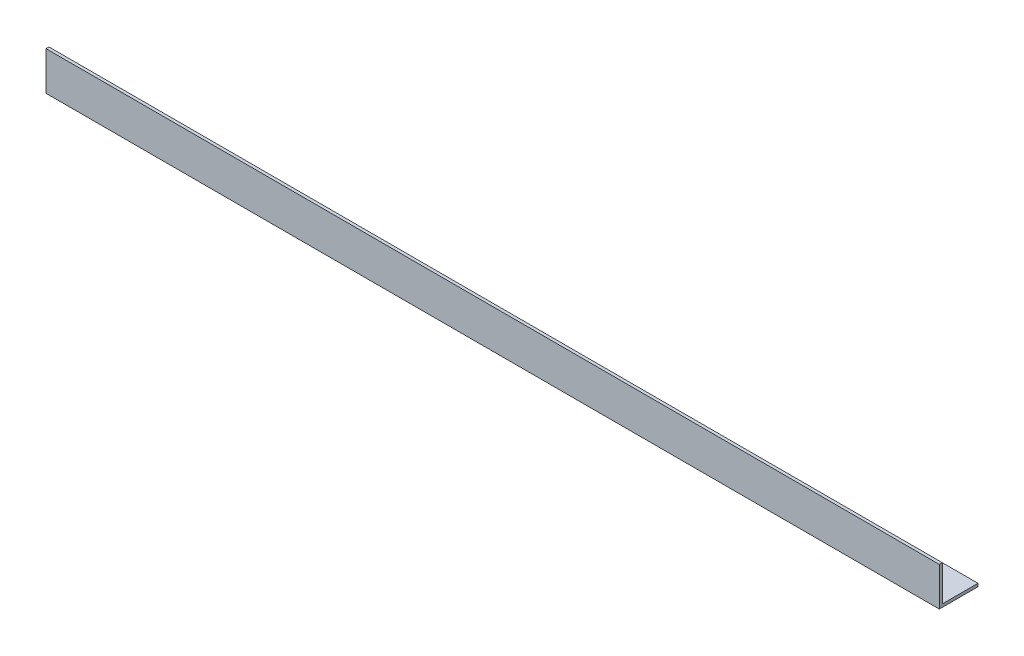
ISO-10303-21;
HEADER;
FILE_DESCRIPTION(('STEP AP214'),'2;1');
FILE_NAME('part.step','',(''),(''),'','','');
FILE_SCHEMA(('AUTOMOTIVE_DESIGN { 1 0 10303 214 1 1 1 1 }'));
ENDSEC;
DATA;
#1=APPLICATION_CONTEXT('core data for automotive mechanical design processes');
#2=APPLICATION_PROTOCOL_DEFINITION('international standard','automotive_design',2000,#1);
#3=PRODUCT_CONTEXT('',#1,'mechanical');
#4=PRODUCT('Part','Part','',(#3));
#5=PRODUCT_RELATED_PRODUCT_CATEGORY('part','',(#4));
#6=PRODUCT_DEFINITION_FORMATION('','',#4);
#7=PRODUCT_DEFINITION_CONTEXT('part definition',#1,'design');
#8=PRODUCT_DEFINITION('design','',#6,#7);
#9=PRODUCT_DEFINITION_SHAPE('','',#8);
#10=(LENGTH_UNIT() NAMED_UNIT(*) SI_UNIT(.MILLI.,.METRE.));
#11=(NAMED_UNIT(*) PLANE_ANGLE_UNIT() SI_UNIT($,.RADIAN.));
#12=(NAMED_UNIT(*) SI_UNIT($,.STERADIAN.) SOLID_ANGLE_UNIT());
#13=UNCERTAINTY_MEASURE_WITH_UNIT(LENGTH_MEASURE(1.E-05),#10,'distance_accuracy_value','');
#14=(GEOMETRIC_REPRESENTATION_CONTEXT(3) GLOBAL_UNCERTAINTY_ASSIGNED_CONTEXT((#13)) GLOBAL_UNIT_ASSIGNED_CONTEXT((#10,
#11,#12)) REPRESENTATION_CONTEXT('',''));
#15=CARTESIAN_POINT('',(0.,0.,0.));
#16=DIRECTION('',(0.,0.,1.));
#17=DIRECTION('',(1.,0.,0.));
#18=AXIS2_PLACEMENT_3D('',#15,#16,#17);
#19=CARTESIAN_POINT('',(1500.,0.,0.));
#20=DIRECTION('',(0.,1.,0.));
#21=DIRECTION('',(0.,0.,1.));
#22=AXIS2_PLACEMENT_3D('',#19,#20,#21);
#23=PLANE('',#22);
#24=DIRECTION('',(0.,0.,-1.));
#25=VECTOR('',#24,1.);
#26=CARTESIAN_POINT('',(0.,0.,0.));
#27=LINE('',#26,#25);
#28=CARTESIAN_POINT('',(0.,0.,0.));
#29=VERTEX_POINT('',#28);
#30=CARTESIAN_POINT('',(0.,0.,-65.));
#31=VERTEX_POINT('',#30);
#32=EDGE_CURVE('E115',#29,#31,#27,.T.);
#33=ORIENTED_EDGE('',*,*,#32,.T.);
#34=DIRECTION('',(-1.,0.,0.));
#35=VECTOR('',#34,1.);
#36=CARTESIAN_POINT('',(1500.,0.,-65.));
#37=LINE('',#36,#35);
#38=CARTESIAN_POINT('',(1500.,0.,-65.));
#39=VERTEX_POINT('',#38);
#40=EDGE_CURVE('E11',#39,#31,#37,.T.);
#41=ORIENTED_EDGE('',*,*,#40,.F.);
#42=DIRECTION('',(0.,0.,-1.));
#43=VECTOR('',#42,1.);
#44=CARTESIAN_POINT('',(1500.,0.,0.));
#45=LINE('',#44,#43);
#46=CARTESIAN_POINT('',(1500.,0.,0.));
#47=VERTEX_POINT('',#46);
#48=EDGE_CURVE('E80',#47,#39,#45,.T.);
#49=ORIENTED_EDGE('',*,*,#48,.F.);
#50=DIRECTION('',(-1.,0.,0.));
#51=VECTOR('',#50,1.);
#52=CARTESIAN_POINT('',(1500.,0.,0.));
#53=LINE('',#52,#51);
#54=EDGE_CURVE('E111',#47,#29,#53,.T.);
#55=ORIENTED_EDGE('',*,*,#54,.T.);
#56=EDGE_LOOP('',(#33,#41,#49,#55));
#57=FACE_BOUND('',#56,.T.);
#58=ADVANCED_FACE('F34',(#57),#23,.F.);
#59=CARTESIAN_POINT('',(1500.,5.,-65.));
#60=DIRECTION('',(0.,0.,-1.));
#61=DIRECTION('',(-1.,0.,0.));
#62=AXIS2_PLACEMENT_3D('',#59,#60,#61);
#63=PLANE('',#62);
#64=DIRECTION('',(0.,-1.,0.));
#65=VECTOR('',#64,1.);
#66=CARTESIAN_POINT('',(0.,5.,-65.));
#67=LINE('',#66,#65);
#68=CARTESIAN_POINT('',(0.,5.,-65.));
#69=VERTEX_POINT('',#68);
#70=EDGE_CURVE('E118',#69,#31,#67,.T.);
#71=ORIENTED_EDGE('',*,*,#70,.F.);
#72=DIRECTION('',(-1.,0.,0.));
#73=VECTOR('',#72,1.);
#74=CARTESIAN_POINT('',(1500.,5.,-65.));
#75=LINE('',#74,#73);
#76=CARTESIAN_POINT('',(1500.,5.,-65.));
#77=VERTEX_POINT('',#76);
#78=EDGE_CURVE('E42',#77,#69,#75,.T.);
#79=ORIENTED_EDGE('',*,*,#78,.F.);
#80=DIRECTION('',(0.,-1.,0.));
#81=VECTOR('',#80,1.);
#82=CARTESIAN_POINT('',(1500.,5.,-65.));
#83=LINE('',#82,#81);
#84=EDGE_CURVE('E204',#77,#39,#83,.T.);
#85=ORIENTED_EDGE('',*,*,#84,.T.);
#86=ORIENTED_EDGE('',*,*,#40,.T.);
#87=EDGE_LOOP('',(#71,#79,#85,#86));
#88=FACE_BOUND('',#87,.T.);
#89=ADVANCED_FACE('F136',(#88),#63,.T.);
#90=CARTESIAN_POINT('',(1500.,5.,0.));
#91=DIRECTION('',(0.,1.,0.));
#92=DIRECTION('',(0.,0.,1.));
#93=AXIS2_PLACEMENT_3D('',#90,#91,#92);
#94=PLANE('',#93);
#95=DIRECTION('',(0.,0.,-1.));
#96=VECTOR('',#95,1.);
#97=CARTESIAN_POINT('',(0.,5.,0.));
#98=LINE('',#97,#96);
#99=CARTESIAN_POINT('',(0.,5.,-5.));
#100=VERTEX_POINT('',#99);
#101=EDGE_CURVE('E121',#100,#69,#98,.T.);
#102=ORIENTED_EDGE('',*,*,#101,.F.);
#103=DIRECTION('',(-1.,0.,0.));
#104=VECTOR('',#103,1.);
#105=CARTESIAN_POINT('',(1500.,5.,-5.));
#106=LINE('',#105,#104);
#107=CARTESIAN_POINT('',(1500.,5.,-5.));
#108=VERTEX_POINT('',#107);
#109=EDGE_CURVE('E101',#108,#100,#106,.T.);
#110=ORIENTED_EDGE('',*,*,#109,.F.);
#111=DIRECTION('',(0.,0.,-1.));
#112=VECTOR('',#111,1.);
#113=CARTESIAN_POINT('',(1500.,5.,0.));
#114=LINE('',#113,#112);
#115=EDGE_CURVE('E107',#108,#77,#114,.T.);
#116=ORIENTED_EDGE('',*,*,#115,.T.);
#117=ORIENTED_EDGE('',*,*,#78,.T.);
#118=EDGE_LOOP('',(#102,#110,#116,#117));
#119=FACE_BOUND('',#118,.T.);
#120=ADVANCED_FACE('F133',(#119),#94,.T.);
#121=CARTESIAN_POINT('',(1500.,0.,-5.));
#122=DIRECTION('',(0.,0.,-1.));
#123=DIRECTION('',(-1.,0.,0.));
#124=AXIS2_PLACEMENT_3D('',#121,#122,#123);
#125=PLANE('',#124);
#126=DIRECTION('',(0.,1.,0.));
#127=VECTOR('',#126,1.);
#128=CARTESIAN_POINT('',(0.,0.,-5.));
#129=LINE('',#128,#127);
#130=CARTESIAN_POINT('',(0.,65.,-5.));
#131=VERTEX_POINT('',#130);
#132=EDGE_CURVE('E96',#131,#100,#129,.F.);
#133=ORIENTED_EDGE('',*,*,#132,.F.);
#134=DIRECTION('',(-1.,0.,0.));
#135=VECTOR('',#134,1.);
#136=CARTESIAN_POINT('',(1500.,65.,-5.));
#137=LINE('',#136,#135);
#138=CARTESIAN_POINT('',(1500.,65.,-5.));
#139=VERTEX_POINT('',#138);
#140=EDGE_CURVE('E91',#139,#131,#137,.T.);
#141=ORIENTED_EDGE('',*,*,#140,.F.);
#142=DIRECTION('',(0.,1.,0.));
#143=VECTOR('',#142,1.);
#144=CARTESIAN_POINT('',(1500.,0.,-5.));
#145=LINE('',#144,#143);
#146=EDGE_CURVE('E94',#139,#108,#145,.F.);
#147=ORIENTED_EDGE('',*,*,#146,.T.);
#148=ORIENTED_EDGE('',*,*,#109,.T.);
#149=EDGE_LOOP('',(#133,#141,#147,#148));
#150=FACE_BOUND('',#149,.T.);
#151=ADVANCED_FACE('F93',(#150),#125,.T.);
#152=CARTESIAN_POINT('',(1500.,65.,0.));
#153=DIRECTION('',(0.,1.,0.));
#154=DIRECTION('',(0.,0.,1.));
#155=AXIS2_PLACEMENT_3D('',#152,#153,#154);
#156=PLANE('',#155);
#157=DIRECTION('',(0.,0.,-1.));
#158=VECTOR('',#157,1.);
#159=CARTESIAN_POINT('',(0.,65.,0.));
#160=LINE('',#159,#158);
#161=CARTESIAN_POINT('',(0.,65.,0.));
#162=VERTEX_POINT('',#161);
#163=EDGE_CURVE('E125',#162,#131,#160,.T.);
#164=ORIENTED_EDGE('',*,*,#163,.F.);
#165=DIRECTION('',(-1.,0.,0.));
#166=VECTOR('',#165,1.);
#167=CARTESIAN_POINT('',(1500.,65.,0.));
#168=LINE('',#167,#166);
#169=CARTESIAN_POINT('',(1500.,65.,0.));
#170=VERTEX_POINT('',#169);
#171=EDGE_CURVE('E71',#170,#162,#168,.T.);
#172=ORIENTED_EDGE('',*,*,#171,.F.);
#173=DIRECTION('',(0.,0.,-1.));
#174=VECTOR('',#173,1.);
#175=CARTESIAN_POINT('',(1500.,65.,0.));
#176=LINE('',#175,#174);
#177=EDGE_CURVE('E105',#170,#139,#176,.T.);
#178=ORIENTED_EDGE('',*,*,#177,.T.);
#179=ORIENTED_EDGE('',*,*,#140,.T.);
#180=EDGE_LOOP('',(#164,#172,#178,#179));
#181=FACE_BOUND('',#180,.T.);
#182=ADVANCED_FACE('F109',(#181),#156,.T.);
#183=CARTESIAN_POINT('',(1500.,0.,0.));
#184=DIRECTION('',(0.,0.,-1.));
#185=DIRECTION('',(-1.,0.,0.));
#186=AXIS2_PLACEMENT_3D('',#183,#184,#185);
#187=PLANE('',#186);
#188=DIRECTION('',(0.,-1.,0.));
#189=VECTOR('',#188,1.);
#190=CARTESIAN_POINT('',(0.,0.,0.));
#191=LINE('',#190,#189);
#192=EDGE_CURVE('E74',#162,#29,#191,.T.);
#193=ORIENTED_EDGE('',*,*,#192,.T.);
#194=ORIENTED_EDGE('',*,*,#54,.F.);
#195=DIRECTION('',(0.,-1.,0.));
#196=VECTOR('',#195,1.);
#197=CARTESIAN_POINT('',(1500.,0.,0.));
#198=LINE('',#197,#196);
#199=EDGE_CURVE('E50',#170,#47,#198,.T.);
#200=ORIENTED_EDGE('',*,*,#199,.F.);
#201=ORIENTED_EDGE('',*,*,#171,.T.);
#202=EDGE_LOOP('',(#193,#194,#200,#201));
#203=FACE_BOUND('',#202,.T.);
#204=ADVANCED_FACE('F141',(#203),#187,.F.);
#205=CARTESIAN_POINT('',(1500.,0.,0.));
#206=DIRECTION('',(-1.,0.,0.));
#207=DIRECTION('',(0.,0.,1.));
#208=AXIS2_PLACEMENT_3D('',#205,#206,#207);
#209=PLANE('',#208);
#210=ORIENTED_EDGE('',*,*,#48,.T.);
#211=ORIENTED_EDGE('',*,*,#84,.F.);
#212=ORIENTED_EDGE('',*,*,#115,.F.);
#213=ORIENTED_EDGE('',*,*,#146,.F.);
#214=ORIENTED_EDGE('',*,*,#177,.F.);
#215=ORIENTED_EDGE('',*,*,#199,.T.);
#216=EDGE_LOOP('',(#210,#211,#212,#213,#214,#215));
#217=FACE_BOUND('',#216,.T.);
#218=ADVANCED_FACE('F104',(#217),#209,.F.);
#219=CARTESIAN_POINT('',(0.,0.,0.));
#220=DIRECTION('',(-1.,0.,0.));
#221=DIRECTION('',(0.,0.,1.));
#222=AXIS2_PLACEMENT_3D('',#219,#220,#221);
#223=PLANE('',#222);
#224=ORIENTED_EDGE('',*,*,#32,.F.);
#225=ORIENTED_EDGE('',*,*,#192,.F.);
#226=ORIENTED_EDGE('',*,*,#163,.T.);
#227=ORIENTED_EDGE('',*,*,#132,.T.);
#228=ORIENTED_EDGE('',*,*,#101,.T.);
#229=ORIENTED_EDGE('',*,*,#70,.T.);
#230=EDGE_LOOP('',(#224,#225,#226,#227,#228,#229));
#231=FACE_BOUND('',#230,.T.);
#232=ADVANCED_FACE('F139',(#231),#223,.T.);
#233=CLOSED_SHELL('',(#58,#89,#120,#151,#182,#204,#218,#232));
#234=MANIFOLD_SOLID_BREP('B2',#233);
#235=ADVANCED_BREP_SHAPE_REPRESENTATION('',(#18,#234),#14);
#236=SHAPE_DEFINITION_REPRESENTATION(#9,#235);
ENDSEC;
END-ISO-10303-21;
